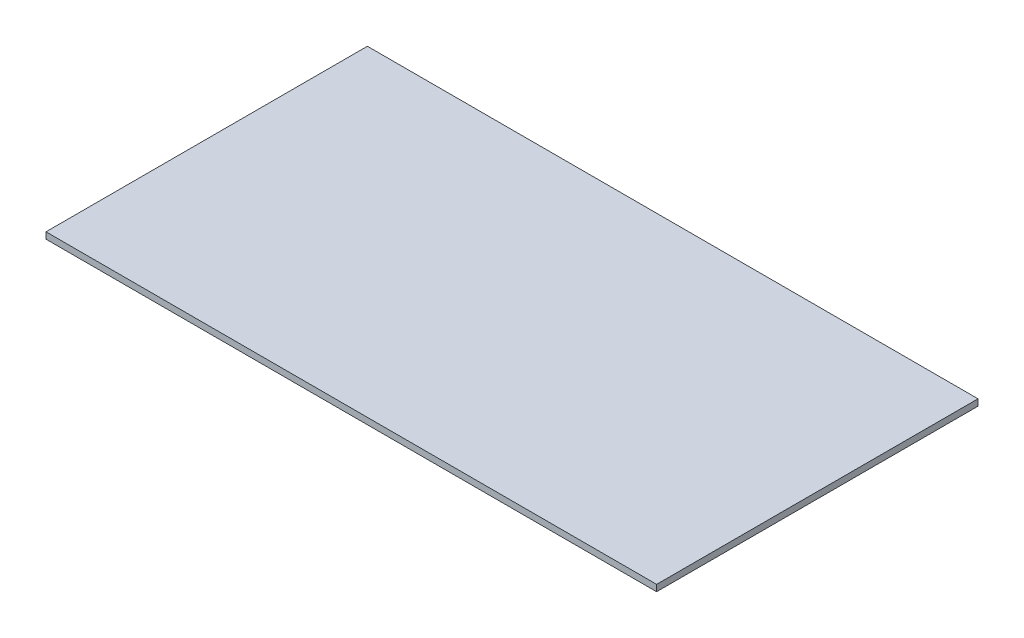
ISO-10303-21;
HEADER;
FILE_DESCRIPTION(('STEP AP214'),'2;1');
FILE_NAME('part.step','',(''),(''),'','','');
FILE_SCHEMA(('AUTOMOTIVE_DESIGN { 1 0 10303 214 1 1 1 1 }'));
ENDSEC;
DATA;
#1=APPLICATION_CONTEXT('core data for automotive mechanical design processes');
#2=APPLICATION_PROTOCOL_DEFINITION('international standard','automotive_design',2000,#1);
#3=PRODUCT_CONTEXT('',#1,'mechanical');
#4=PRODUCT('Part','Part','',(#3));
#5=PRODUCT_RELATED_PRODUCT_CATEGORY('part','',(#4));
#6=PRODUCT_DEFINITION_FORMATION('','',#4);
#7=PRODUCT_DEFINITION_CONTEXT('part definition',#1,'design');
#8=PRODUCT_DEFINITION('design','',#6,#7);
#9=PRODUCT_DEFINITION_SHAPE('','',#8);
#10=(LENGTH_UNIT() NAMED_UNIT(*) SI_UNIT(.MILLI.,.METRE.));
#11=(NAMED_UNIT(*) PLANE_ANGLE_UNIT() SI_UNIT($,.RADIAN.));
#12=(NAMED_UNIT(*) SI_UNIT($,.STERADIAN.) SOLID_ANGLE_UNIT());
#13=UNCERTAINTY_MEASURE_WITH_UNIT(LENGTH_MEASURE(1.E-05),#10,'distance_accuracy_value','');
#14=(GEOMETRIC_REPRESENTATION_CONTEXT(3) GLOBAL_UNCERTAINTY_ASSIGNED_CONTEXT((#13)) GLOBAL_UNIT_ASSIGNED_CONTEXT((#10,
#11,#12)) REPRESENTATION_CONTEXT('',''));
#15=CARTESIAN_POINT('',(0.,0.,0.));
#16=DIRECTION('',(0.,0.,1.));
#17=DIRECTION('',(1.,0.,0.));
#18=AXIS2_PLACEMENT_3D('',#15,#16,#17);
#19=CARTESIAN_POINT('',(47.5,0.5,-25.));
#20=DIRECTION('',(-1.,0.,0.));
#21=DIRECTION('',(0.,0.,1.));
#22=AXIS2_PLACEMENT_3D('',#19,#20,#21);
#23=PLANE('',#22);
#24=DIRECTION('',(0.,0.,-1.));
#25=VECTOR('',#24,1.);
#26=CARTESIAN_POINT('',(47.5,-0.5,-25.));
#27=LINE('',#26,#25);
#28=CARTESIAN_POINT('',(47.5,-0.5,25.));
#29=VERTEX_POINT('',#28);
#30=CARTESIAN_POINT('',(47.5,-0.5,-25.));
#31=VERTEX_POINT('',#30);
#32=EDGE_CURVE('E107',#29,#31,#27,.T.);
#33=ORIENTED_EDGE('',*,*,#32,.T.);
#34=DIRECTION('',(0.,-1.,0.));
#35=VECTOR('',#34,1.);
#36=CARTESIAN_POINT('',(47.5,0.5,-25.));
#37=LINE('',#36,#35);
#38=CARTESIAN_POINT('',(47.5,0.5,-25.));
#39=VERTEX_POINT('',#38);
#40=EDGE_CURVE('E11',#39,#31,#37,.T.);
#41=ORIENTED_EDGE('',*,*,#40,.F.);
#42=DIRECTION('',(0.,0.,-1.));
#43=VECTOR('',#42,1.);
#44=CARTESIAN_POINT('',(47.5,0.5,-25.));
#45=LINE('',#44,#43);
#46=CARTESIAN_POINT('',(47.5,0.5,25.));
#47=VERTEX_POINT('',#46);
#48=EDGE_CURVE('E91',#47,#39,#45,.T.);
#49=ORIENTED_EDGE('',*,*,#48,.F.);
#50=DIRECTION('',(0.,-1.,0.));
#51=VECTOR('',#50,1.);
#52=CARTESIAN_POINT('',(47.5,0.5,25.));
#53=LINE('',#52,#51);
#54=EDGE_CURVE('E103',#47,#29,#53,.T.);
#55=ORIENTED_EDGE('',*,*,#54,.T.);
#56=EDGE_LOOP('',(#33,#41,#49,#55));
#57=FACE_BOUND('',#56,.T.);
#58=ADVANCED_FACE('F39',(#57),#23,.F.);
#59=CARTESIAN_POINT('',(-47.5,0.5,-25.));
#60=DIRECTION('',(0.,0.,1.));
#61=DIRECTION('',(1.,0.,0.));
#62=AXIS2_PLACEMENT_3D('',#59,#60,#61);
#63=PLANE('',#62);
#64=DIRECTION('',(-1.,0.,0.));
#65=VECTOR('',#64,1.);
#66=CARTESIAN_POINT('',(-47.5,-0.5,-25.));
#67=LINE('',#66,#65);
#68=CARTESIAN_POINT('',(-47.5,-0.5,-25.));
#69=VERTEX_POINT('',#68);
#70=EDGE_CURVE('E96',#31,#69,#67,.T.);
#71=ORIENTED_EDGE('',*,*,#70,.T.);
#72=DIRECTION('',(0.,-1.,0.));
#73=VECTOR('',#72,1.);
#74=CARTESIAN_POINT('',(-47.5,0.5,-25.));
#75=LINE('',#74,#73);
#76=CARTESIAN_POINT('',(-47.5,0.5,-25.));
#77=VERTEX_POINT('',#76);
#78=EDGE_CURVE('E48',#77,#69,#75,.T.);
#79=ORIENTED_EDGE('',*,*,#78,.F.);
#80=DIRECTION('',(-1.,0.,0.));
#81=VECTOR('',#80,1.);
#82=CARTESIAN_POINT('',(-47.5,0.5,-25.));
#83=LINE('',#82,#81);
#84=EDGE_CURVE('E86',#39,#77,#83,.T.);
#85=ORIENTED_EDGE('',*,*,#84,.F.);
#86=ORIENTED_EDGE('',*,*,#40,.T.);
#87=EDGE_LOOP('',(#71,#79,#85,#86));
#88=FACE_BOUND('',#87,.T.);
#89=ADVANCED_FACE('F95',(#88),#63,.F.);
#90=CARTESIAN_POINT('',(-47.5,0.5,-25.));
#91=DIRECTION('',(1.,0.,0.));
#92=DIRECTION('',(0.,0.,-1.));
#93=AXIS2_PLACEMENT_3D('',#90,#91,#92);
#94=PLANE('',#93);
#95=DIRECTION('',(0.,0.,1.));
#96=VECTOR('',#95,1.);
#97=CARTESIAN_POINT('',(-47.5,-0.5,-25.));
#98=LINE('',#97,#96);
#99=CARTESIAN_POINT('',(-47.5,-0.5,25.));
#100=VERTEX_POINT('',#99);
#101=EDGE_CURVE('E73',#69,#100,#98,.T.);
#102=ORIENTED_EDGE('',*,*,#101,.T.);
#103=DIRECTION('',(0.,-1.,0.));
#104=VECTOR('',#103,1.);
#105=CARTESIAN_POINT('',(-47.5,0.5,25.));
#106=LINE('',#105,#104);
#107=CARTESIAN_POINT('',(-47.5,0.5,25.));
#108=VERTEX_POINT('',#107);
#109=EDGE_CURVE('E98',#108,#100,#106,.T.);
#110=ORIENTED_EDGE('',*,*,#109,.F.);
#111=DIRECTION('',(0.,0.,1.));
#112=VECTOR('',#111,1.);
#113=CARTESIAN_POINT('',(-47.5,0.5,-25.));
#114=LINE('',#113,#112);
#115=EDGE_CURVE('E89',#77,#108,#114,.T.);
#116=ORIENTED_EDGE('',*,*,#115,.F.);
#117=ORIENTED_EDGE('',*,*,#78,.T.);
#118=EDGE_LOOP('',(#102,#110,#116,#117));
#119=FACE_BOUND('',#118,.T.);
#120=ADVANCED_FACE('F99',(#119),#94,.F.);
#121=CARTESIAN_POINT('',(-47.5,0.5,25.));
#122=DIRECTION('',(0.,0.,-1.));
#123=DIRECTION('',(-1.,0.,0.));
#124=AXIS2_PLACEMENT_3D('',#121,#122,#123);
#125=PLANE('',#124);
#126=DIRECTION('',(1.,0.,0.));
#127=VECTOR('',#126,1.);
#128=CARTESIAN_POINT('',(-47.5,-0.5,25.));
#129=LINE('',#128,#127);
#130=EDGE_CURVE('E79',#100,#29,#129,.T.);
#131=ORIENTED_EDGE('',*,*,#130,.T.);
#132=ORIENTED_EDGE('',*,*,#54,.F.);
#133=DIRECTION('',(1.,0.,0.));
#134=VECTOR('',#133,1.);
#135=CARTESIAN_POINT('',(-47.5,0.5,25.));
#136=LINE('',#135,#134);
#137=EDGE_CURVE('E56',#108,#47,#136,.T.);
#138=ORIENTED_EDGE('',*,*,#137,.F.);
#139=ORIENTED_EDGE('',*,*,#109,.T.);
#140=EDGE_LOOP('',(#131,#132,#138,#139));
#141=FACE_BOUND('',#140,.T.);
#142=ADVANCED_FACE('F120',(#141),#125,.F.);
#143=CARTESIAN_POINT('',(0.,0.5,0.));
#144=DIRECTION('',(0.,1.,0.));
#145=DIRECTION('',(0.,0.,1.));
#146=AXIS2_PLACEMENT_3D('',#143,#144,#145);
#147=PLANE('',#146);
#148=ORIENTED_EDGE('',*,*,#48,.T.);
#149=ORIENTED_EDGE('',*,*,#84,.T.);
#150=ORIENTED_EDGE('',*,*,#115,.T.);
#151=ORIENTED_EDGE('',*,*,#137,.T.);
#152=EDGE_LOOP('',(#148,#149,#150,#151));
#153=FACE_BOUND('',#152,.T.);
#154=ADVANCED_FACE('F87',(#153),#147,.T.);
#155=CARTESIAN_POINT('',(0.,-0.5,0.));
#156=DIRECTION('',(0.,1.,0.));
#157=DIRECTION('',(0.,0.,1.));
#158=AXIS2_PLACEMENT_3D('',#155,#156,#157);
#159=PLANE('',#158);
#160=ORIENTED_EDGE('',*,*,#32,.F.);
#161=ORIENTED_EDGE('',*,*,#130,.F.);
#162=ORIENTED_EDGE('',*,*,#101,.F.);
#163=ORIENTED_EDGE('',*,*,#70,.F.);
#164=EDGE_LOOP('',(#160,#161,#162,#163));
#165=FACE_BOUND('',#164,.T.);
#166=ADVANCED_FACE('F123',(#165),#159,.F.);
#167=CLOSED_SHELL('',(#58,#89,#120,#142,#154,#166));
#168=MANIFOLD_SOLID_BREP('B2',#167);
#169=ADVANCED_BREP_SHAPE_REPRESENTATION('',(#18,#168),#14);
#170=SHAPE_DEFINITION_REPRESENTATION(#9,#169);
ENDSEC;
END-ISO-10303-21;
